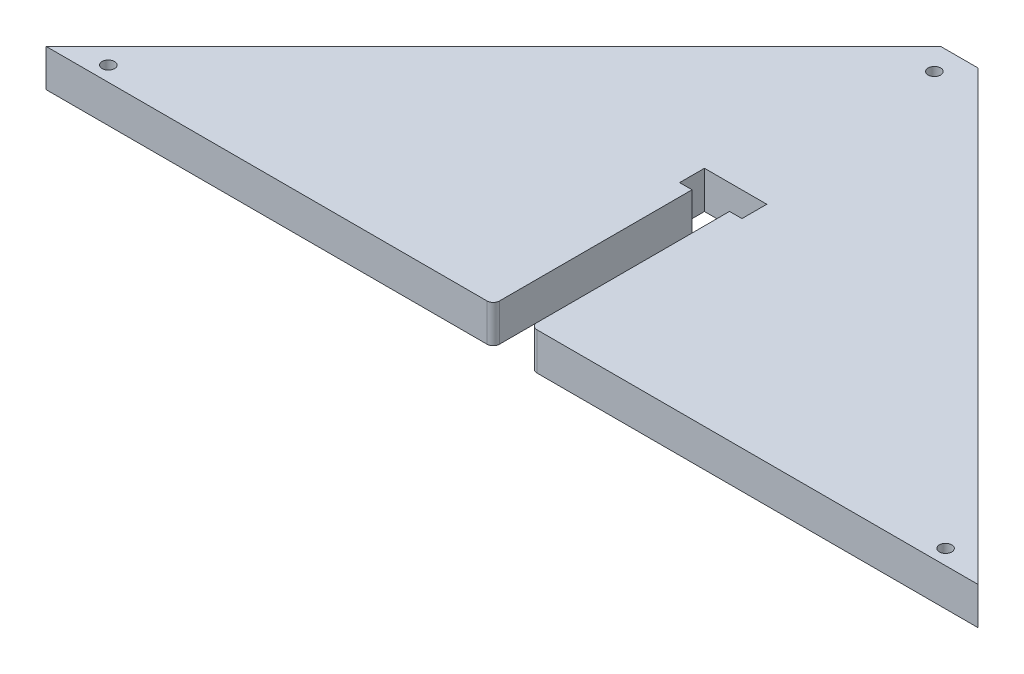
ISO-10303-21;
HEADER;
FILE_DESCRIPTION(('STEP AP214'),'2;1');
FILE_NAME('part.step','',(''),(''),'','','');
FILE_SCHEMA(('AUTOMOTIVE_DESIGN { 1 0 10303 214 1 1 1 1 }'));
ENDSEC;
DATA;
#1=APPLICATION_CONTEXT('core data for automotive mechanical design processes');
#2=APPLICATION_PROTOCOL_DEFINITION('international standard','automotive_design',2000,#1);
#3=PRODUCT_CONTEXT('',#1,'mechanical');
#4=PRODUCT('Part','Part','',(#3));
#5=PRODUCT_RELATED_PRODUCT_CATEGORY('part','',(#4));
#6=PRODUCT_DEFINITION_FORMATION('','',#4);
#7=PRODUCT_DEFINITION_CONTEXT('part definition',#1,'design');
#8=PRODUCT_DEFINITION('design','',#6,#7);
#9=PRODUCT_DEFINITION_SHAPE('','',#8);
#10=(LENGTH_UNIT() NAMED_UNIT(*) SI_UNIT(.MILLI.,.METRE.));
#11=(NAMED_UNIT(*) PLANE_ANGLE_UNIT() SI_UNIT($,.RADIAN.));
#12=(NAMED_UNIT(*) SI_UNIT($,.STERADIAN.) SOLID_ANGLE_UNIT());
#13=UNCERTAINTY_MEASURE_WITH_UNIT(LENGTH_MEASURE(1.E-05),#10,'distance_accuracy_value','');
#14=(GEOMETRIC_REPRESENTATION_CONTEXT(3) GLOBAL_UNCERTAINTY_ASSIGNED_CONTEXT((#13)) GLOBAL_UNIT_ASSIGNED_CONTEXT((#10,
#11,#12)) REPRESENTATION_CONTEXT('',''));
#15=CARTESIAN_POINT('',(0.,0.,0.));
#16=DIRECTION('',(0.,0.,1.));
#17=DIRECTION('',(1.,0.,0.));
#18=AXIS2_PLACEMENT_3D('',#15,#16,#17);
#19=CARTESIAN_POINT('',(45.6526615969582,18.1,30.4505703422054));
#20=DIRECTION('',(0.,1.,0.));
#21=DIRECTION('',(0.,0.,1.));
#22=AXIS2_PLACEMENT_3D('',#19,#20,#21);
#23=PLANE('',#22);
#24=CARTESIAN_POINT('',(235.716045652263,18.1,26.2254190911903));
#25=DIRECTION('',(0.,1.,0.));
#26=DIRECTION('',(0.,0.,1.));
#27=AXIS2_PLACEMENT_3D('',#24,#25,#26);
#28=CIRCLE('',#27,2.99999999999999);
#29=CARTESIAN_POINT('',(235.716045652263,18.1,29.2254190911903));
#30=VERTEX_POINT('',#29);
#31=EDGE_CURVE('E319',#30,#30,#28,.T.);
#32=ORIENTED_EDGE('',*,*,#31,.F.);
#33=EDGE_LOOP('',(#32));
#34=FACE_BOUND('',#33,.T.);
#35=DIRECTION('',(-0.707106781186548,0.,0.707106781186548));
#36=VECTOR('',#35,1.);
#37=CARTESIAN_POINT('',(-191.397338403042,18.1,33.4505703422054));
#38=LINE('',#37,#36);
#39=CARTESIAN_POINT('',(24.5526615969581,18.1,-182.499429657795));
#40=VERTEX_POINT('',#39);
#41=CARTESIAN_POINT('',(-191.397338403042,18.1,33.4505703422054));
#42=VERTEX_POINT('',#41);
#43=EDGE_CURVE('E200',#40,#42,#38,.T.);
#44=ORIENTED_EDGE('',*,*,#43,.T.);
#45=DIRECTION('',(1.,0.,0.));
#46=VECTOR('',#45,1.);
#47=CARTESIAN_POINT('',(-191.397338403042,18.1,33.4505703422054));
#48=LINE('',#47,#46);
#49=CARTESIAN_POINT('',(21.5526615969582,18.1,33.4505703422054));
#50=VERTEX_POINT('',#49);
#51=EDGE_CURVE('E114',#42,#50,#48,.T.);
#52=ORIENTED_EDGE('',*,*,#51,.T.);
#53=CARTESIAN_POINT('',(21.5526615969582,18.1,30.4505703422054));
#54=DIRECTION('',(0.,1.,0.));
#55=DIRECTION('',(0.,0.,1.));
#56=AXIS2_PLACEMENT_3D('',#53,#54,#55);
#57=CIRCLE('',#56,3.);
#58=CARTESIAN_POINT('',(24.5526615969582,18.1,30.4505703422054));
#59=VERTEX_POINT('',#58);
#60=EDGE_CURVE('E233',#50,#59,#57,.T.);
#61=ORIENTED_EDGE('',*,*,#60,.T.);
#62=DIRECTION('',(0.,0.,-1.));
#63=VECTOR('',#62,1.);
#64=CARTESIAN_POINT('',(24.5526615969582,18.1,-62.5244296577946));
#65=LINE('',#64,#63);
#66=CARTESIAN_POINT('',(24.5526615969582,18.1,-62.5244296577946));
#67=VERTEX_POINT('',#66);
#68=EDGE_CURVE('E252',#59,#67,#65,.T.);
#69=ORIENTED_EDGE('',*,*,#68,.T.);
#70=DIRECTION('',(-1.,0.,0.));
#71=VECTOR('',#70,1.);
#72=CARTESIAN_POINT('',(24.5526615969582,18.1,-62.5244296577946));
#73=LINE('',#72,#71);
#74=CARTESIAN_POINT('',(18.5526615969582,18.1,-62.5244296577946));
#75=VERTEX_POINT('',#74);
#76=EDGE_CURVE('E249',#67,#75,#73,.T.);
#77=ORIENTED_EDGE('',*,*,#76,.T.);
#78=DIRECTION('',(0.,0.,-1.));
#79=VECTOR('',#78,1.);
#80=CARTESIAN_POINT('',(18.5526615969582,18.1,-62.5244296577946));
#81=LINE('',#80,#79);
#82=CARTESIAN_POINT('',(18.5526615969582,18.1,-74.5244296577946));
#83=VERTEX_POINT('',#82);
#84=EDGE_CURVE('E251',#75,#83,#81,.T.);
#85=ORIENTED_EDGE('',*,*,#84,.T.);
#86=DIRECTION('',(1.,0.,0.));
#87=VECTOR('',#86,1.);
#88=CARTESIAN_POINT('',(18.5526615969582,18.1,-74.5244296577946));
#89=LINE('',#88,#87);
#90=CARTESIAN_POINT('',(48.6526615969581,18.1,-74.5244296577946));
#91=VERTEX_POINT('',#90);
#92=EDGE_CURVE('E254',#83,#91,#89,.T.);
#93=ORIENTED_EDGE('',*,*,#92,.T.);
#94=DIRECTION('',(0.,0.,1.));
#95=VECTOR('',#94,1.);
#96=CARTESIAN_POINT('',(48.6526615969581,18.1,-74.5244296577946));
#97=LINE('',#96,#95);
#98=CARTESIAN_POINT('',(48.6526615969581,18.1,-62.5244296577946));
#99=VERTEX_POINT('',#98);
#100=EDGE_CURVE('E260',#91,#99,#97,.T.);
#101=ORIENTED_EDGE('',*,*,#100,.T.);
#102=DIRECTION('',(-1.,0.,0.));
#103=VECTOR('',#102,1.);
#104=CARTESIAN_POINT('',(48.6526615969581,18.1,-62.5244296577946));
#105=LINE('',#104,#103);
#106=CARTESIAN_POINT('',(42.6526615969582,18.1,-62.5244296577946));
#107=VERTEX_POINT('',#106);
#108=EDGE_CURVE('E262',#99,#107,#105,.T.);
#109=ORIENTED_EDGE('',*,*,#108,.T.);
#110=DIRECTION('',(0.,0.,1.));
#111=VECTOR('',#110,1.);
#112=CARTESIAN_POINT('',(42.6526615969582,18.1,-62.5244296577946));
#113=LINE('',#112,#111);
#114=CARTESIAN_POINT('',(42.6526615969582,18.1,30.4505703422054));
#115=VERTEX_POINT('',#114);
#116=EDGE_CURVE('E264',#107,#115,#113,.T.);
#117=ORIENTED_EDGE('',*,*,#116,.T.);
#118=CARTESIAN_POINT('',(45.6526615969582,18.1,30.4505703422054));
#119=DIRECTION('',(0.,1.,0.));
#120=DIRECTION('',(0.,0.,1.));
#121=AXIS2_PLACEMENT_3D('',#118,#119,#120);
#122=CIRCLE('',#121,2.99999999999999);
#123=CARTESIAN_POINT('',(45.6526615969582,18.1,33.4505703422053));
#124=VERTEX_POINT('',#123);
#125=EDGE_CURVE('E151',#115,#124,#122,.T.);
#126=ORIENTED_EDGE('',*,*,#125,.T.);
#127=DIRECTION('',(1.,0.,0.));
#128=VECTOR('',#127,1.);
#129=CARTESIAN_POINT('',(45.6526615969582,18.1,33.4505703422053));
#130=LINE('',#129,#128);
#131=CARTESIAN_POINT('',(258.602661596958,18.1,33.4505703422054));
#132=VERTEX_POINT('',#131);
#133=EDGE_CURVE('E145',#124,#132,#130,.T.);
#134=ORIENTED_EDGE('',*,*,#133,.T.);
#135=DIRECTION('',(-0.707106781186548,0.,-0.707106781186547));
#136=VECTOR('',#135,1.);
#137=CARTESIAN_POINT('',(42.6526615969581,18.1,-182.499429657795));
#138=LINE('',#137,#136);
#139=CARTESIAN_POINT('',(42.6526615969581,18.1,-182.499429657795));
#140=VERTEX_POINT('',#139);
#141=EDGE_CURVE('E149',#132,#140,#138,.T.);
#142=ORIENTED_EDGE('',*,*,#141,.T.);
#143=DIRECTION('',(-1.,0.,0.));
#144=VECTOR('',#143,1.);
#145=CARTESIAN_POINT('',(24.5526615969581,18.1,-182.499429657795));
#146=LINE('',#145,#144);
#147=EDGE_CURVE('E53',#140,#40,#146,.T.);
#148=ORIENTED_EDGE('',*,*,#147,.T.);
#149=EDGE_LOOP('',(#44,#52,#61,#69,#77,#85,#93,#101,#109,#117,#126,#134,#142,#148));
#150=FACE_BOUND('',#149,.T.);
#151=CARTESIAN_POINT('',(33.6026615969581,18.1,-170.499429657795));
#152=DIRECTION('',(0.,1.,0.));
#153=DIRECTION('',(0.,0.,1.));
#154=AXIS2_PLACEMENT_3D('',#151,#152,#153);
#155=CIRCLE('',#154,3.00000000000001);
#156=CARTESIAN_POINT('',(33.6026615969581,18.1,-167.499429657795));
#157=VERTEX_POINT('',#156);
#158=EDGE_CURVE('E175',#157,#157,#155,.T.);
#159=ORIENTED_EDGE('',*,*,#158,.F.);
#160=EDGE_LOOP('',(#159));
#161=FACE_BOUND('',#160,.T.);
#162=CARTESIAN_POINT('',(-168.510722458347,18.1,26.2254190911903));
#163=DIRECTION('',(0.,1.,0.));
#164=DIRECTION('',(0.,0.,1.));
#165=AXIS2_PLACEMENT_3D('',#162,#163,#164);
#166=CIRCLE('',#165,2.99999999999999);
#167=CARTESIAN_POINT('',(-168.510722458347,18.1,29.2254190911903));
#168=VERTEX_POINT('',#167);
#169=EDGE_CURVE('E310',#168,#168,#166,.T.);
#170=ORIENTED_EDGE('',*,*,#169,.F.);
#171=EDGE_LOOP('',(#170));
#172=FACE_BOUND('',#171,.T.);
#173=ADVANCED_FACE('F36',(#34,#150,#161,#172),#23,.T.);
#174=CARTESIAN_POINT('',(45.6526615969582,0.,30.4505703422054));
#175=DIRECTION('',(0.,1.,0.));
#176=DIRECTION('',(0.,0.,1.));
#177=AXIS2_PLACEMENT_3D('',#174,#175,#176);
#178=PLANE('',#177);
#179=DIRECTION('',(-0.707106781186548,0.,0.707106781186548));
#180=VECTOR('',#179,1.);
#181=CARTESIAN_POINT('',(-191.397338403042,0.,33.4505703422054));
#182=LINE('',#181,#180);
#183=CARTESIAN_POINT('',(24.5526615969581,0.,-182.499429657795));
#184=VERTEX_POINT('',#183);
#185=CARTESIAN_POINT('',(-191.397338403042,0.,33.4505703422054));
#186=VERTEX_POINT('',#185);
#187=EDGE_CURVE('E171',#184,#186,#182,.T.);
#188=ORIENTED_EDGE('',*,*,#187,.F.);
#189=DIRECTION('',(-1.,0.,0.));
#190=VECTOR('',#189,1.);
#191=CARTESIAN_POINT('',(24.5526615969581,0.,-182.499429657795));
#192=LINE('',#191,#190);
#193=CARTESIAN_POINT('',(42.6526615969581,0.,-182.499429657795));
#194=VERTEX_POINT('',#193);
#195=EDGE_CURVE('E106',#194,#184,#192,.T.);
#196=ORIENTED_EDGE('',*,*,#195,.F.);
#197=DIRECTION('',(-0.707106781186548,0.,-0.707106781186547));
#198=VECTOR('',#197,1.);
#199=CARTESIAN_POINT('',(42.6526615969581,0.,-182.499429657795));
#200=LINE('',#199,#198);
#201=CARTESIAN_POINT('',(258.602661596958,0.,33.4505703422054));
#202=VERTEX_POINT('',#201);
#203=EDGE_CURVE('E100',#202,#194,#200,.T.);
#204=ORIENTED_EDGE('',*,*,#203,.F.);
#205=DIRECTION('',(1.,0.,0.));
#206=VECTOR('',#205,1.);
#207=CARTESIAN_POINT('',(45.6526615969582,0.,33.4505703422053));
#208=LINE('',#207,#206);
#209=CARTESIAN_POINT('',(45.6526615969582,0.,33.4505703422053));
#210=VERTEX_POINT('',#209);
#211=EDGE_CURVE('E159',#210,#202,#208,.T.);
#212=ORIENTED_EDGE('',*,*,#211,.F.);
#213=CARTESIAN_POINT('',(45.6526615969582,0.,30.4505703422054));
#214=DIRECTION('',(0.,1.,0.));
#215=DIRECTION('',(0.,0.,1.));
#216=AXIS2_PLACEMENT_3D('',#213,#214,#215);
#217=CIRCLE('',#216,2.99999999999999);
#218=CARTESIAN_POINT('',(42.6526615969582,0.,30.4505703422054));
#219=VERTEX_POINT('',#218);
#220=EDGE_CURVE('E194',#219,#210,#217,.T.);
#221=ORIENTED_EDGE('',*,*,#220,.F.);
#222=DIRECTION('',(0.,0.,1.));
#223=VECTOR('',#222,1.);
#224=CARTESIAN_POINT('',(42.6526615969582,0.,-62.5244296577946));
#225=LINE('',#224,#223);
#226=CARTESIAN_POINT('',(42.6526615969582,0.,-62.5244296577946));
#227=VERTEX_POINT('',#226);
#228=EDGE_CURVE('E192',#227,#219,#225,.T.);
#229=ORIENTED_EDGE('',*,*,#228,.F.);
#230=DIRECTION('',(-1.,0.,0.));
#231=VECTOR('',#230,1.);
#232=CARTESIAN_POINT('',(48.6526615969581,0.,-62.5244296577946));
#233=LINE('',#232,#231);
#234=CARTESIAN_POINT('',(48.6526615969581,0.,-62.5244296577946));
#235=VERTEX_POINT('',#234);
#236=EDGE_CURVE('E190',#235,#227,#233,.T.);
#237=ORIENTED_EDGE('',*,*,#236,.F.);
#238=DIRECTION('',(0.,0.,1.));
#239=VECTOR('',#238,1.);
#240=CARTESIAN_POINT('',(48.6526615969581,0.,-74.5244296577946));
#241=LINE('',#240,#239);
#242=CARTESIAN_POINT('',(48.6526615969581,0.,-74.5244296577946));
#243=VERTEX_POINT('',#242);
#244=EDGE_CURVE('E188',#243,#235,#241,.T.);
#245=ORIENTED_EDGE('',*,*,#244,.F.);
#246=DIRECTION('',(1.,0.,0.));
#247=VECTOR('',#246,1.);
#248=CARTESIAN_POINT('',(42.6526615969582,0.,-74.5244296577946));
#249=LINE('',#248,#247);
#250=CARTESIAN_POINT('',(18.5526615969582,0.,-74.5244296577946));
#251=VERTEX_POINT('',#250);
#252=EDGE_CURVE('E186',#251,#243,#249,.T.);
#253=ORIENTED_EDGE('',*,*,#252,.F.);
#254=DIRECTION('',(0.,0.,-1.));
#255=VECTOR('',#254,1.);
#256=CARTESIAN_POINT('',(18.5526615969582,0.,-62.5244296577946));
#257=LINE('',#256,#255);
#258=CARTESIAN_POINT('',(18.5526615969582,0.,-62.5244296577946));
#259=VERTEX_POINT('',#258);
#260=EDGE_CURVE('E183',#259,#251,#257,.T.);
#261=ORIENTED_EDGE('',*,*,#260,.F.);
#262=DIRECTION('',(-1.,0.,0.));
#263=VECTOR('',#262,1.);
#264=CARTESIAN_POINT('',(24.5526615969582,0.,-62.5244296577946));
#265=LINE('',#264,#263);
#266=CARTESIAN_POINT('',(24.5526615969582,0.,-62.5244296577946));
#267=VERTEX_POINT('',#266);
#268=EDGE_CURVE('E181',#267,#259,#265,.T.);
#269=ORIENTED_EDGE('',*,*,#268,.F.);
#270=DIRECTION('',(0.,0.,-1.));
#271=VECTOR('',#270,1.);
#272=CARTESIAN_POINT('',(24.5526615969582,0.,-62.5244296577946));
#273=LINE('',#272,#271);
#274=CARTESIAN_POINT('',(24.5526615969582,0.,30.4505703422054));
#275=VERTEX_POINT('',#274);
#276=EDGE_CURVE('E179',#275,#267,#273,.T.);
#277=ORIENTED_EDGE('',*,*,#276,.F.);
#278=CARTESIAN_POINT('',(21.5526615969582,0.,30.4505703422054));
#279=DIRECTION('',(0.,1.,0.));
#280=DIRECTION('',(0.,0.,1.));
#281=AXIS2_PLACEMENT_3D('',#278,#279,#280);
#282=CIRCLE('',#281,3.);
#283=CARTESIAN_POINT('',(21.5526615969582,0.,33.4505703422054));
#284=VERTEX_POINT('',#283);
#285=EDGE_CURVE('E177',#284,#275,#282,.T.);
#286=ORIENTED_EDGE('',*,*,#285,.F.);
#287=DIRECTION('',(1.,0.,0.));
#288=VECTOR('',#287,1.);
#289=CARTESIAN_POINT('',(-191.397338403042,0.,33.4505703422054));
#290=LINE('',#289,#288);
#291=EDGE_CURVE('E174',#186,#284,#290,.T.);
#292=ORIENTED_EDGE('',*,*,#291,.F.);
#293=EDGE_LOOP('',(#188,#196,#204,#212,#221,#229,#237,#245,#253,#261,#269,#277,#286,#292));
#294=FACE_BOUND('',#293,.T.);
#295=CARTESIAN_POINT('',(33.6026615969581,0.,-170.499429657795));
#296=DIRECTION('',(0.,1.,0.));
#297=DIRECTION('',(0.,0.,1.));
#298=AXIS2_PLACEMENT_3D('',#295,#296,#297);
#299=CIRCLE('',#298,3.00000000000001);
#300=CARTESIAN_POINT('',(33.6026615969581,0.,-167.499429657795));
#301=VERTEX_POINT('',#300);
#302=EDGE_CURVE('E322',#301,#301,#299,.T.);
#303=ORIENTED_EDGE('',*,*,#302,.T.);
#304=EDGE_LOOP('',(#303));
#305=FACE_BOUND('',#304,.T.);
#306=CARTESIAN_POINT('',(235.716045652263,0.,26.2254190911903));
#307=DIRECTION('',(0.,1.,0.));
#308=DIRECTION('',(0.,0.,1.));
#309=AXIS2_PLACEMENT_3D('',#306,#307,#308);
#310=CIRCLE('',#309,2.99999999999999);
#311=CARTESIAN_POINT('',(235.716045652263,0.,29.2254190911903));
#312=VERTEX_POINT('',#311);
#313=EDGE_CURVE('E316',#312,#312,#310,.T.);
#314=ORIENTED_EDGE('',*,*,#313,.T.);
#315=EDGE_LOOP('',(#314));
#316=FACE_BOUND('',#315,.T.);
#317=CARTESIAN_POINT('',(-168.510722458347,0.,26.2254190911903));
#318=DIRECTION('',(0.,1.,0.));
#319=DIRECTION('',(0.,0.,1.));
#320=AXIS2_PLACEMENT_3D('',#317,#318,#319);
#321=CIRCLE('',#320,2.99999999999999);
#322=CARTESIAN_POINT('',(-168.510722458347,0.,29.2254190911903));
#323=VERTEX_POINT('',#322);
#324=EDGE_CURVE('E313',#323,#323,#321,.T.);
#325=ORIENTED_EDGE('',*,*,#324,.T.);
#326=EDGE_LOOP('',(#325));
#327=FACE_BOUND('',#326,.T.);
#328=ADVANCED_FACE('F237',(#294,#305,#316,#327),#178,.F.);
#329=CARTESIAN_POINT('',(-191.397338403042,18.1,33.4505703422054));
#330=DIRECTION('',(0.707106781186548,0.,0.707106781186548));
#331=DIRECTION('',(0.707106781186548,0.,-0.707106781186548));
#332=AXIS2_PLACEMENT_3D('',#329,#330,#331);
#333=PLANE('',#332);
#334=ORIENTED_EDGE('',*,*,#187,.T.);
#335=DIRECTION('',(0.,-1.,0.));
#336=VECTOR('',#335,1.);
#337=CARTESIAN_POINT('',(-191.397338403042,18.1,33.4505703422054));
#338=LINE('',#337,#336);
#339=EDGE_CURVE('E11',#42,#186,#338,.T.);
#340=ORIENTED_EDGE('',*,*,#339,.F.);
#341=ORIENTED_EDGE('',*,*,#43,.F.);
#342=DIRECTION('',(0.,-1.,0.));
#343=VECTOR('',#342,1.);
#344=CARTESIAN_POINT('',(24.5526615969581,18.1,-182.499429657795));
#345=LINE('',#344,#343);
#346=EDGE_CURVE('E167',#40,#184,#345,.T.);
#347=ORIENTED_EDGE('',*,*,#346,.T.);
#348=EDGE_LOOP('',(#334,#340,#341,#347));
#349=FACE_BOUND('',#348,.T.);
#350=ADVANCED_FACE('F38',(#349),#333,.F.);
#351=CARTESIAN_POINT('',(-191.397338403042,18.1,33.4505703422054));
#352=DIRECTION('',(0.,0.,-1.));
#353=DIRECTION('',(-1.,0.,0.));
#354=AXIS2_PLACEMENT_3D('',#351,#352,#353);
#355=PLANE('',#354);
#356=ORIENTED_EDGE('',*,*,#291,.T.);
#357=DIRECTION('',(0.,-1.,0.));
#358=VECTOR('',#357,1.);
#359=CARTESIAN_POINT('',(21.5526615969582,18.1,33.4505703422054));
#360=LINE('',#359,#358);
#361=EDGE_CURVE('E45',#50,#284,#360,.T.);
#362=ORIENTED_EDGE('',*,*,#361,.F.);
#363=ORIENTED_EDGE('',*,*,#51,.F.);
#364=ORIENTED_EDGE('',*,*,#339,.T.);
#365=EDGE_LOOP('',(#356,#362,#363,#364));
#366=FACE_BOUND('',#365,.T.);
#367=ADVANCED_FACE('F447',(#366),#355,.F.);
#368=CARTESIAN_POINT('',(21.5526615969582,18.1,30.4505703422054));
#369=DIRECTION('',(0.,-1.,0.));
#370=DIRECTION('',(0.,0.,-1.));
#371=AXIS2_PLACEMENT_3D('',#368,#369,#370);
#372=CYLINDRICAL_SURFACE('',#371,3.);
#373=ORIENTED_EDGE('',*,*,#285,.T.);
#374=DIRECTION('',(0.,-1.,0.));
#375=VECTOR('',#374,1.);
#376=CARTESIAN_POINT('',(24.5526615969582,18.1,30.4505703422054));
#377=LINE('',#376,#375);
#378=EDGE_CURVE('E225',#59,#275,#377,.T.);
#379=ORIENTED_EDGE('',*,*,#378,.F.);
#380=ORIENTED_EDGE('',*,*,#60,.F.);
#381=ORIENTED_EDGE('',*,*,#361,.T.);
#382=EDGE_LOOP('',(#373,#379,#380,#381));
#383=FACE_BOUND('',#382,.T.);
#384=ADVANCED_FACE('F231',(#383),#372,.T.);
#385=CARTESIAN_POINT('',(24.5526615969582,18.1,-62.5244296577946));
#386=DIRECTION('',(-1.,0.,0.));
#387=DIRECTION('',(0.,0.,1.));
#388=AXIS2_PLACEMENT_3D('',#385,#386,#387);
#389=PLANE('',#388);
#390=ORIENTED_EDGE('',*,*,#276,.T.);
#391=DIRECTION('',(0.,-1.,0.));
#392=VECTOR('',#391,1.);
#393=CARTESIAN_POINT('',(24.5526615969582,18.1,-62.5244296577946));
#394=LINE('',#393,#392);
#395=EDGE_CURVE('E222',#67,#267,#394,.T.);
#396=ORIENTED_EDGE('',*,*,#395,.F.);
#397=ORIENTED_EDGE('',*,*,#68,.F.);
#398=ORIENTED_EDGE('',*,*,#378,.T.);
#399=EDGE_LOOP('',(#390,#396,#397,#398));
#400=FACE_BOUND('',#399,.T.);
#401=ADVANCED_FACE('F243',(#400),#389,.F.);
#402=CARTESIAN_POINT('',(24.5526615969582,18.1,-62.5244296577946));
#403=DIRECTION('',(0.,0.,1.));
#404=DIRECTION('',(1.,0.,0.));
#405=AXIS2_PLACEMENT_3D('',#402,#403,#404);
#406=PLANE('',#405);
#407=ORIENTED_EDGE('',*,*,#268,.T.);
#408=DIRECTION('',(0.,-1.,0.));
#409=VECTOR('',#408,1.);
#410=CARTESIAN_POINT('',(18.5526615969582,18.1,-62.5244296577946));
#411=LINE('',#410,#409);
#412=EDGE_CURVE('E219',#75,#259,#411,.T.);
#413=ORIENTED_EDGE('',*,*,#412,.F.);
#414=ORIENTED_EDGE('',*,*,#76,.F.);
#415=ORIENTED_EDGE('',*,*,#395,.T.);
#416=EDGE_LOOP('',(#407,#413,#414,#415));
#417=FACE_BOUND('',#416,.T.);
#418=ADVANCED_FACE('F247',(#417),#406,.F.);
#419=CARTESIAN_POINT('',(18.5526615969582,18.1,-62.5244296577946));
#420=DIRECTION('',(-1.,0.,0.));
#421=DIRECTION('',(0.,0.,1.));
#422=AXIS2_PLACEMENT_3D('',#419,#420,#421);
#423=PLANE('',#422);
#424=ORIENTED_EDGE('',*,*,#260,.T.);
#425=DIRECTION('',(0.,-1.,0.));
#426=VECTOR('',#425,1.);
#427=CARTESIAN_POINT('',(18.5526615969582,18.1,-74.5244296577946));
#428=LINE('',#427,#426);
#429=EDGE_CURVE('E216',#83,#251,#428,.T.);
#430=ORIENTED_EDGE('',*,*,#429,.F.);
#431=ORIENTED_EDGE('',*,*,#84,.F.);
#432=ORIENTED_EDGE('',*,*,#412,.T.);
#433=EDGE_LOOP('',(#424,#430,#431,#432));
#434=FACE_BOUND('',#433,.T.);
#435=ADVANCED_FACE('F410',(#434),#423,.F.);
#436=CARTESIAN_POINT('',(42.6526615969582,18.1,-74.5244296577946));
#437=DIRECTION('',(0.,0.,-1.));
#438=DIRECTION('',(-1.,0.,0.));
#439=AXIS2_PLACEMENT_3D('',#436,#437,#438);
#440=PLANE('',#439);
#441=ORIENTED_EDGE('',*,*,#252,.T.);
#442=DIRECTION('',(0.,-1.,0.));
#443=VECTOR('',#442,1.);
#444=CARTESIAN_POINT('',(48.6526615969581,18.1,-74.5244296577946));
#445=LINE('',#444,#443);
#446=EDGE_CURVE('E213',#91,#243,#445,.T.);
#447=ORIENTED_EDGE('',*,*,#446,.F.);
#448=ORIENTED_EDGE('',*,*,#92,.F.);
#449=ORIENTED_EDGE('',*,*,#429,.T.);
#450=EDGE_LOOP('',(#441,#447,#448,#449));
#451=FACE_BOUND('',#450,.T.);
#452=ADVANCED_FACE('F400',(#451),#440,.F.);
#453=CARTESIAN_POINT('',(48.6526615969581,18.1,-74.5244296577946));
#454=DIRECTION('',(1.,0.,0.));
#455=DIRECTION('',(0.,0.,-1.));
#456=AXIS2_PLACEMENT_3D('',#453,#454,#455);
#457=PLANE('',#456);
#458=ORIENTED_EDGE('',*,*,#244,.T.);
#459=DIRECTION('',(0.,-1.,0.));
#460=VECTOR('',#459,1.);
#461=CARTESIAN_POINT('',(48.6526615969581,18.1,-62.5244296577946));
#462=LINE('',#461,#460);
#463=EDGE_CURVE('E210',#99,#235,#462,.T.);
#464=ORIENTED_EDGE('',*,*,#463,.F.);
#465=ORIENTED_EDGE('',*,*,#100,.F.);
#466=ORIENTED_EDGE('',*,*,#446,.T.);
#467=EDGE_LOOP('',(#458,#464,#465,#466));
#468=FACE_BOUND('',#467,.T.);
#469=ADVANCED_FACE('F390',(#468),#457,.F.);
#470=CARTESIAN_POINT('',(48.6526615969581,18.1,-62.5244296577946));
#471=DIRECTION('',(0.,0.,1.));
#472=DIRECTION('',(1.,0.,0.));
#473=AXIS2_PLACEMENT_3D('',#470,#471,#472);
#474=PLANE('',#473);
#475=ORIENTED_EDGE('',*,*,#236,.T.);
#476=DIRECTION('',(0.,-1.,0.));
#477=VECTOR('',#476,1.);
#478=CARTESIAN_POINT('',(42.6526615969582,18.1,-62.5244296577946));
#479=LINE('',#478,#477);
#480=EDGE_CURVE('E207',#107,#227,#479,.T.);
#481=ORIENTED_EDGE('',*,*,#480,.F.);
#482=ORIENTED_EDGE('',*,*,#108,.F.);
#483=ORIENTED_EDGE('',*,*,#463,.T.);
#484=EDGE_LOOP('',(#475,#481,#482,#483));
#485=FACE_BOUND('',#484,.T.);
#486=ADVANCED_FACE('F381',(#485),#474,.F.);
#487=CARTESIAN_POINT('',(42.6526615969582,18.1,-62.5244296577946));
#488=DIRECTION('',(1.,0.,0.));
#489=DIRECTION('',(0.,0.,-1.));
#490=AXIS2_PLACEMENT_3D('',#487,#488,#489);
#491=PLANE('',#490);
#492=ORIENTED_EDGE('',*,*,#228,.T.);
#493=DIRECTION('',(0.,-1.,0.));
#494=VECTOR('',#493,1.);
#495=CARTESIAN_POINT('',(42.6526615969582,18.1,30.4505703422054));
#496=LINE('',#495,#494);
#497=EDGE_CURVE('E204',#115,#219,#496,.T.);
#498=ORIENTED_EDGE('',*,*,#497,.F.);
#499=ORIENTED_EDGE('',*,*,#116,.F.);
#500=ORIENTED_EDGE('',*,*,#480,.T.);
#501=EDGE_LOOP('',(#492,#498,#499,#500));
#502=FACE_BOUND('',#501,.T.);
#503=ADVANCED_FACE('F270',(#502),#491,.F.);
#504=CARTESIAN_POINT('',(45.6526615969582,18.1,30.4505703422054));
#505=DIRECTION('',(0.,-1.,0.));
#506=DIRECTION('',(0.,0.,-1.));
#507=AXIS2_PLACEMENT_3D('',#504,#505,#506);
#508=CYLINDRICAL_SURFACE('',#507,2.99999999999999);
#509=ORIENTED_EDGE('',*,*,#220,.T.);
#510=DIRECTION('',(0.,-1.,0.));
#511=VECTOR('',#510,1.);
#512=CARTESIAN_POINT('',(45.6526615969582,18.1,33.4505703422053));
#513=LINE('',#512,#511);
#514=EDGE_CURVE('E160',#124,#210,#513,.T.);
#515=ORIENTED_EDGE('',*,*,#514,.F.);
#516=ORIENTED_EDGE('',*,*,#125,.F.);
#517=ORIENTED_EDGE('',*,*,#497,.T.);
#518=EDGE_LOOP('',(#509,#515,#516,#517));
#519=FACE_BOUND('',#518,.T.);
#520=ADVANCED_FACE('F274',(#519),#508,.T.);
#521=CARTESIAN_POINT('',(45.6526615969582,18.1,33.4505703422053));
#522=DIRECTION('',(0.,0.,-1.));
#523=DIRECTION('',(-1.,0.,0.));
#524=AXIS2_PLACEMENT_3D('',#521,#522,#523);
#525=PLANE('',#524);
#526=ORIENTED_EDGE('',*,*,#211,.T.);
#527=DIRECTION('',(0.,-1.,0.));
#528=VECTOR('',#527,1.);
#529=CARTESIAN_POINT('',(258.602661596958,18.1,33.4505703422054));
#530=LINE('',#529,#528);
#531=EDGE_CURVE('E156',#132,#202,#530,.T.);
#532=ORIENTED_EDGE('',*,*,#531,.F.);
#533=ORIENTED_EDGE('',*,*,#133,.F.);
#534=ORIENTED_EDGE('',*,*,#514,.T.);
#535=EDGE_LOOP('',(#526,#532,#533,#534));
#536=FACE_BOUND('',#535,.T.);
#537=ADVANCED_FACE('F157',(#536),#525,.F.);
#538=CARTESIAN_POINT('',(42.6526615969581,18.1,-182.499429657795));
#539=DIRECTION('',(-0.707106781186547,0.,0.707106781186548));
#540=DIRECTION('',(0.707106781186548,0.,0.707106781186547));
#541=AXIS2_PLACEMENT_3D('',#538,#539,#540);
#542=PLANE('',#541);
#543=ORIENTED_EDGE('',*,*,#203,.T.);
#544=DIRECTION('',(0.,-1.,0.));
#545=VECTOR('',#544,1.);
#546=CARTESIAN_POINT('',(42.6526615969581,18.1,-182.499429657795));
#547=LINE('',#546,#545);
#548=EDGE_CURVE('E161',#140,#194,#547,.T.);
#549=ORIENTED_EDGE('',*,*,#548,.F.);
#550=ORIENTED_EDGE('',*,*,#141,.F.);
#551=ORIENTED_EDGE('',*,*,#531,.T.);
#552=EDGE_LOOP('',(#543,#549,#550,#551));
#553=FACE_BOUND('',#552,.T.);
#554=ADVANCED_FACE('F163',(#553),#542,.F.);
#555=CARTESIAN_POINT('',(24.5526615969581,18.1,-182.499429657795));
#556=DIRECTION('',(0.,0.,1.));
#557=DIRECTION('',(1.,0.,0.));
#558=AXIS2_PLACEMENT_3D('',#555,#556,#557);
#559=PLANE('',#558);
#560=ORIENTED_EDGE('',*,*,#195,.T.);
#561=ORIENTED_EDGE('',*,*,#346,.F.);
#562=ORIENTED_EDGE('',*,*,#147,.F.);
#563=ORIENTED_EDGE('',*,*,#548,.T.);
#564=EDGE_LOOP('',(#560,#561,#562,#563));
#565=FACE_BOUND('',#564,.T.);
#566=ADVANCED_FACE('F278',(#565),#559,.F.);
#567=CARTESIAN_POINT('',(33.6026615969581,18.1,-170.499429657795));
#568=DIRECTION('',(0.,-1.,0.));
#569=DIRECTION('',(0.,0.,-1.));
#570=AXIS2_PLACEMENT_3D('',#567,#568,#569);
#571=CYLINDRICAL_SURFACE('',#570,3.00000000000001);
#572=ORIENTED_EDGE('',*,*,#158,.T.);
#573=EDGE_LOOP('',(#572));
#574=FACE_BOUND('',#573,.T.);
#575=ORIENTED_EDGE('',*,*,#302,.F.);
#576=EDGE_LOOP('',(#575));
#577=FACE_BOUND('',#576,.T.);
#578=ADVANCED_FACE('F280',(#574,#577),#571,.F.);
#579=CARTESIAN_POINT('',(235.716045652263,18.1,26.2254190911903));
#580=DIRECTION('',(0.,-1.,0.));
#581=DIRECTION('',(0.,0.,-1.));
#582=AXIS2_PLACEMENT_3D('',#579,#580,#581);
#583=CYLINDRICAL_SURFACE('',#582,2.99999999999999);
#584=ORIENTED_EDGE('',*,*,#31,.T.);
#585=EDGE_LOOP('',(#584));
#586=FACE_BOUND('',#585,.T.);
#587=ORIENTED_EDGE('',*,*,#313,.F.);
#588=EDGE_LOOP('',(#587));
#589=FACE_BOUND('',#588,.T.);
#590=ADVANCED_FACE('F286',(#586,#589),#583,.F.);
#591=CARTESIAN_POINT('',(-168.510722458347,18.1,26.2254190911903));
#592=DIRECTION('',(0.,-1.,0.));
#593=DIRECTION('',(0.,0.,-1.));
#594=AXIS2_PLACEMENT_3D('',#591,#592,#593);
#595=CYLINDRICAL_SURFACE('',#594,2.99999999999999);
#596=ORIENTED_EDGE('',*,*,#169,.T.);
#597=EDGE_LOOP('',(#596));
#598=FACE_BOUND('',#597,.T.);
#599=ORIENTED_EDGE('',*,*,#324,.F.);
#600=EDGE_LOOP('',(#599));
#601=FACE_BOUND('',#600,.T.);
#602=ADVANCED_FACE('F301',(#598,#601),#595,.F.);
#603=CLOSED_SHELL('',(#173,#328,#350,#367,#384,#401,#418,#435,#452,#469,#486,#503,#520,#537,
#554,#566,#578,#590,#602));
#604=MANIFOLD_SOLID_BREP('B2',#603);
#605=ADVANCED_BREP_SHAPE_REPRESENTATION('',(#18,#604),#14);
#606=SHAPE_DEFINITION_REPRESENTATION(#9,#605);
ENDSEC;
END-ISO-10303-21;
